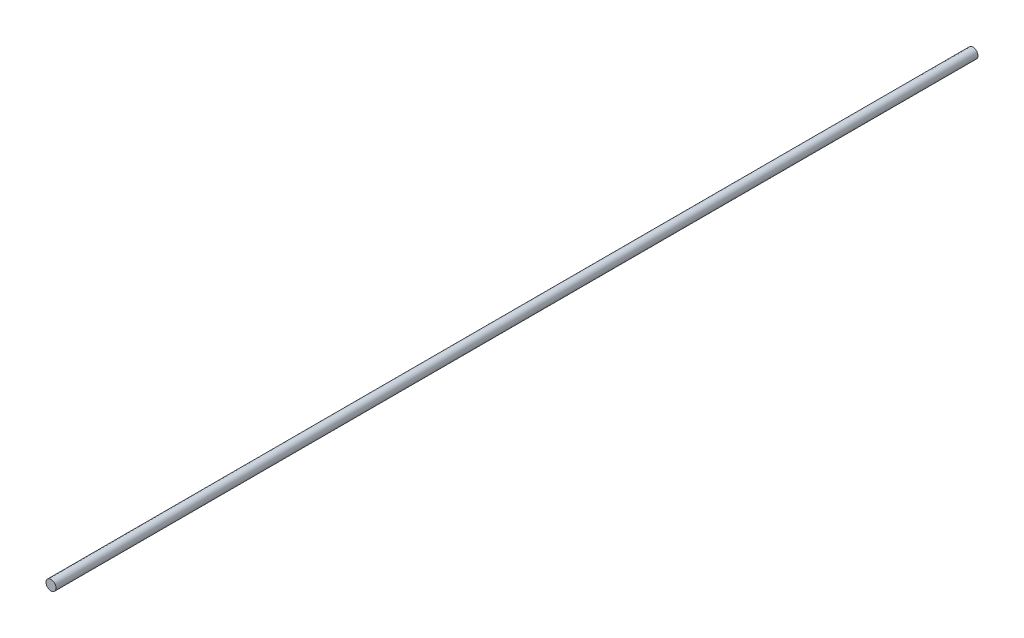
ISO-10303-21;
HEADER;
FILE_DESCRIPTION(('STEP AP214'),'2;1');
FILE_NAME('part.step','',(''),(''),'','','');
FILE_SCHEMA(('AUTOMOTIVE_DESIGN { 1 0 10303 214 1 1 1 1 }'));
ENDSEC;
DATA;
#1=APPLICATION_CONTEXT('core data for automotive mechanical design processes');
#2=APPLICATION_PROTOCOL_DEFINITION('international standard','automotive_design',2000,#1);
#3=PRODUCT_CONTEXT('',#1,'mechanical');
#4=PRODUCT('Part','Part','',(#3));
#5=PRODUCT_RELATED_PRODUCT_CATEGORY('part','',(#4));
#6=PRODUCT_DEFINITION_FORMATION('','',#4);
#7=PRODUCT_DEFINITION_CONTEXT('part definition',#1,'design');
#8=PRODUCT_DEFINITION('design','',#6,#7);
#9=PRODUCT_DEFINITION_SHAPE('','',#8);
#10=(LENGTH_UNIT() NAMED_UNIT(*) SI_UNIT(.MILLI.,.METRE.));
#11=(NAMED_UNIT(*) PLANE_ANGLE_UNIT() SI_UNIT($,.RADIAN.));
#12=(NAMED_UNIT(*) SI_UNIT($,.STERADIAN.) SOLID_ANGLE_UNIT());
#13=UNCERTAINTY_MEASURE_WITH_UNIT(LENGTH_MEASURE(1.E-05),#10,'distance_accuracy_value','');
#14=(GEOMETRIC_REPRESENTATION_CONTEXT(3) GLOBAL_UNCERTAINTY_ASSIGNED_CONTEXT((#13)) GLOBAL_UNIT_ASSIGNED_CONTEXT((#10,
#11,#12)) REPRESENTATION_CONTEXT('',''));
#15=CARTESIAN_POINT('',(0.,0.,0.));
#16=DIRECTION('',(0.,0.,1.));
#17=DIRECTION('',(1.,0.,0.));
#18=AXIS2_PLACEMENT_3D('',#15,#16,#17);
#19=CARTESIAN_POINT('',(0.,0.,2788.5));
#20=DIRECTION('',(0.,0.,-1.));
#21=DIRECTION('',(-1.,0.,0.));
#22=AXIS2_PLACEMENT_3D('',#19,#20,#21);
#23=CYLINDRICAL_SURFACE('',#22,2.75);
#24=CARTESIAN_POINT('',(0.,0.,2788.5));
#25=DIRECTION('',(0.,0.,1.));
#26=DIRECTION('',(1.,0.,0.));
#27=AXIS2_PLACEMENT_3D('',#24,#25,#26);
#28=CIRCLE('',#27,2.75);
#29=CARTESIAN_POINT('',(2.75,0.,2788.5));
#30=VERTEX_POINT('',#29);
#31=EDGE_CURVE('E10',#30,#30,#28,.T.);
#32=ORIENTED_EDGE('',*,*,#31,.F.);
#33=EDGE_LOOP('',(#32));
#34=FACE_BOUND('',#33,.T.);
#35=CARTESIAN_POINT('',(0.,0.,2281.5));
#36=DIRECTION('',(0.,0.,1.));
#37=DIRECTION('',(1.,0.,0.));
#38=AXIS2_PLACEMENT_3D('',#35,#36,#37);
#39=CIRCLE('',#38,2.75);
#40=CARTESIAN_POINT('',(2.75,0.,2281.5));
#41=VERTEX_POINT('',#40);
#42=EDGE_CURVE('E44',#41,#41,#39,.T.);
#43=ORIENTED_EDGE('',*,*,#42,.T.);
#44=EDGE_LOOP('',(#43));
#45=FACE_BOUND('',#44,.T.);
#46=ADVANCED_FACE('F41',(#34,#45),#23,.T.);
#47=CARTESIAN_POINT('',(0.,0.,2788.5));
#48=DIRECTION('',(0.,0.,1.));
#49=DIRECTION('',(1.,0.,0.));
#50=AXIS2_PLACEMENT_3D('',#47,#48,#49);
#51=PLANE('',#50);
#52=ORIENTED_EDGE('',*,*,#31,.T.);
#53=EDGE_LOOP('',(#52));
#54=FACE_BOUND('',#53,.T.);
#55=ADVANCED_FACE('F56',(#54),#51,.T.);
#56=CARTESIAN_POINT('',(0.,0.,2281.5));
#57=DIRECTION('',(0.,0.,1.));
#58=DIRECTION('',(1.,0.,0.));
#59=AXIS2_PLACEMENT_3D('',#56,#57,#58);
#60=PLANE('',#59);
#61=ORIENTED_EDGE('',*,*,#42,.F.);
#62=EDGE_LOOP('',(#61));
#63=FACE_BOUND('',#62,.T.);
#64=ADVANCED_FACE('F54',(#63),#60,.F.);
#65=CLOSED_SHELL('',(#46,#55,#64));
#66=MANIFOLD_SOLID_BREP('B2',#65);
#67=ADVANCED_BREP_SHAPE_REPRESENTATION('',(#18,#66),#14);
#68=SHAPE_DEFINITION_REPRESENTATION(#9,#67);
ENDSEC;
END-ISO-10303-21;
